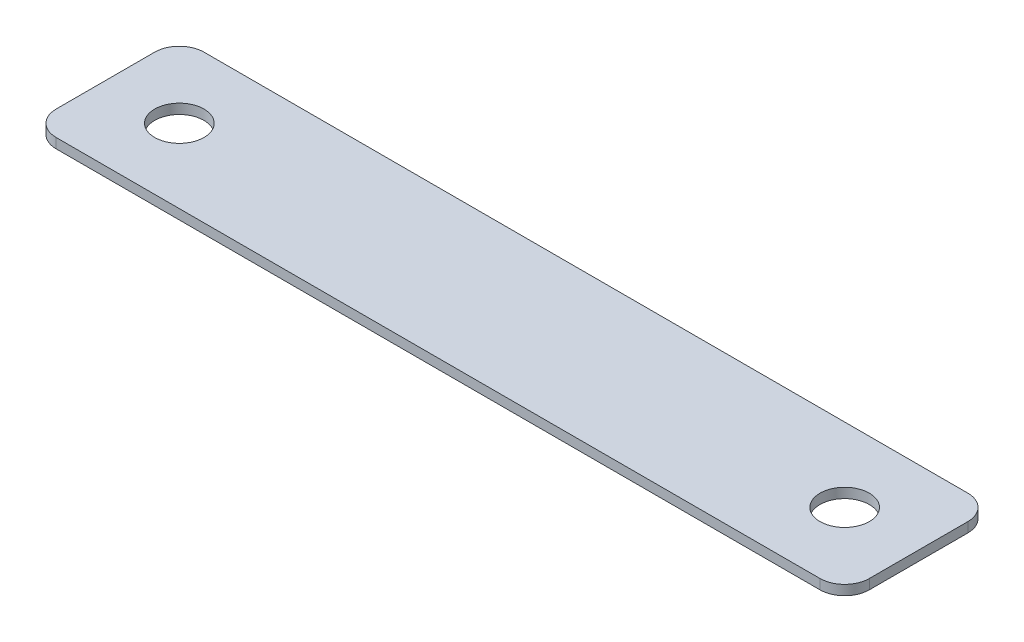
ISO-10303-21;
HEADER;
FILE_DESCRIPTION(('STEP AP214'),'2;1');
FILE_NAME('part.step','',(''),(''),'','','');
FILE_SCHEMA(('AUTOMOTIVE_DESIGN { 1 0 10303 214 1 1 1 1 }'));
ENDSEC;
DATA;
#1=APPLICATION_CONTEXT('core data for automotive mechanical design processes');
#2=APPLICATION_PROTOCOL_DEFINITION('international standard','automotive_design',2000,#1);
#3=PRODUCT_CONTEXT('',#1,'mechanical');
#4=PRODUCT('Part','Part','',(#3));
#5=PRODUCT_RELATED_PRODUCT_CATEGORY('part','',(#4));
#6=PRODUCT_DEFINITION_FORMATION('','',#4);
#7=PRODUCT_DEFINITION_CONTEXT('part definition',#1,'design');
#8=PRODUCT_DEFINITION('design','',#6,#7);
#9=PRODUCT_DEFINITION_SHAPE('','',#8);
#10=(LENGTH_UNIT() NAMED_UNIT(*) SI_UNIT(.MILLI.,.METRE.));
#11=(NAMED_UNIT(*) PLANE_ANGLE_UNIT() SI_UNIT($,.RADIAN.));
#12=(NAMED_UNIT(*) SI_UNIT($,.STERADIAN.) SOLID_ANGLE_UNIT());
#13=UNCERTAINTY_MEASURE_WITH_UNIT(LENGTH_MEASURE(1.E-05),#10,'distance_accuracy_value','');
#14=(GEOMETRIC_REPRESENTATION_CONTEXT(3) GLOBAL_UNCERTAINTY_ASSIGNED_CONTEXT((#13)) GLOBAL_UNIT_ASSIGNED_CONTEXT((#10,
#11,#12)) REPRESENTATION_CONTEXT('',''));
#15=CARTESIAN_POINT('',(0.,0.,0.));
#16=DIRECTION('',(0.,0.,1.));
#17=DIRECTION('',(1.,0.,0.));
#18=AXIS2_PLACEMENT_3D('',#15,#16,#17);
#19=CARTESIAN_POINT('',(203.2,2.54,-6.35));
#20=DIRECTION('',(0.,-1.,0.));
#21=DIRECTION('',(0.,0.,-1.));
#22=AXIS2_PLACEMENT_3D('',#19,#20,#21);
#23=PLANE('',#22);
#24=CARTESIAN_POINT('',(203.2,2.54,-6.35));
#25=DIRECTION('',(0.,1.,0.));
#26=DIRECTION('',(0.,0.,-1.));
#27=AXIS2_PLACEMENT_3D('',#24,#25,#26);
#28=CIRCLE('',#27,6.35);
#29=CARTESIAN_POINT('',(203.2,2.54,0.));
#30=VERTEX_POINT('',#29);
#31=CARTESIAN_POINT('',(209.55,2.54,-6.35));
#32=VERTEX_POINT('',#31);
#33=EDGE_CURVE('E145',#30,#32,#28,.T.);
#34=ORIENTED_EDGE('',*,*,#33,.T.);
#35=DIRECTION('',(0.,0.,-1.));
#36=VECTOR('',#35,1.);
#37=CARTESIAN_POINT('',(209.55,2.54,-31.75));
#38=LINE('',#37,#36);
#39=CARTESIAN_POINT('',(209.55,2.54,-31.75));
#40=VERTEX_POINT('',#39);
#41=EDGE_CURVE('E93',#32,#40,#38,.T.);
#42=ORIENTED_EDGE('',*,*,#41,.T.);
#43=CARTESIAN_POINT('',(203.2,2.54,-31.75));
#44=DIRECTION('',(0.,1.,0.));
#45=DIRECTION('',(0.,0.,1.));
#46=AXIS2_PLACEMENT_3D('',#43,#44,#45);
#47=CIRCLE('',#46,6.35);
#48=CARTESIAN_POINT('',(203.2,2.54,-38.1));
#49=VERTEX_POINT('',#48);
#50=EDGE_CURVE('E160',#40,#49,#47,.T.);
#51=ORIENTED_EDGE('',*,*,#50,.T.);
#52=DIRECTION('',(-1.,0.,0.));
#53=VECTOR('',#52,1.);
#54=CARTESIAN_POINT('',(6.35000000000004,2.54,-38.1));
#55=LINE('',#54,#53);
#56=CARTESIAN_POINT('',(6.35000000000004,2.54,-38.1));
#57=VERTEX_POINT('',#56);
#58=EDGE_CURVE('E173',#49,#57,#55,.T.);
#59=ORIENTED_EDGE('',*,*,#58,.T.);
#60=CARTESIAN_POINT('',(6.35,2.54,-31.75));
#61=DIRECTION('',(0.,1.,0.));
#62=DIRECTION('',(0.,0.,-1.));
#63=AXIS2_PLACEMENT_3D('',#60,#61,#62);
#64=CIRCLE('',#63,6.35);
#65=CARTESIAN_POINT('',(0.,2.54,-31.7499999999999));
#66=VERTEX_POINT('',#65);
#67=EDGE_CURVE('E112',#57,#66,#64,.T.);
#68=ORIENTED_EDGE('',*,*,#67,.T.);
#69=DIRECTION('',(0.,0.,1.));
#70=VECTOR('',#69,1.);
#71=CARTESIAN_POINT('',(0.,2.54,-6.35000000000004));
#72=LINE('',#71,#70);
#73=CARTESIAN_POINT('',(0.,2.54,-6.35000000000004));
#74=VERTEX_POINT('',#73);
#75=EDGE_CURVE('E106',#66,#74,#72,.T.);
#76=ORIENTED_EDGE('',*,*,#75,.T.);
#77=CARTESIAN_POINT('',(6.35,2.54,-6.35));
#78=DIRECTION('',(0.,1.,0.));
#79=DIRECTION('',(0.,0.,-1.));
#80=AXIS2_PLACEMENT_3D('',#77,#78,#79);
#81=CIRCLE('',#80,6.35);
#82=CARTESIAN_POINT('',(6.35000000000005,2.54,0.));
#83=VERTEX_POINT('',#82);
#84=EDGE_CURVE('E110',#74,#83,#81,.T.);
#85=ORIENTED_EDGE('',*,*,#84,.T.);
#86=DIRECTION('',(1.,0.,0.));
#87=VECTOR('',#86,1.);
#88=CARTESIAN_POINT('',(6.35000000000004,2.54,0.));
#89=LINE('',#88,#87);
#90=EDGE_CURVE('E50',#83,#30,#89,.T.);
#91=ORIENTED_EDGE('',*,*,#90,.T.);
#92=EDGE_LOOP('',(#34,#42,#51,#59,#68,#76,#85,#91));
#93=FACE_BOUND('',#92,.T.);
#94=CARTESIAN_POINT('',(19.05,2.54,-19.05));
#95=DIRECTION('',(0.,1.,0.));
#96=DIRECTION('',(0.,0.,1.));
#97=AXIS2_PLACEMENT_3D('',#94,#95,#96);
#98=CIRCLE('',#97,6.35);
#99=CARTESIAN_POINT('',(19.05,2.54,-12.7));
#100=VERTEX_POINT('',#99);
#101=EDGE_CURVE('E134',#100,#100,#98,.T.);
#102=ORIENTED_EDGE('',*,*,#101,.F.);
#103=EDGE_LOOP('',(#102));
#104=FACE_BOUND('',#103,.T.);
#105=CARTESIAN_POINT('',(190.5,2.54,-19.05));
#106=DIRECTION('',(0.,1.,0.));
#107=DIRECTION('',(0.,0.,1.));
#108=AXIS2_PLACEMENT_3D('',#105,#106,#107);
#109=CIRCLE('',#108,6.35);
#110=CARTESIAN_POINT('',(190.5,2.54,-12.7));
#111=VERTEX_POINT('',#110);
#112=EDGE_CURVE('E182',#111,#111,#109,.T.);
#113=ORIENTED_EDGE('',*,*,#112,.F.);
#114=EDGE_LOOP('',(#113));
#115=FACE_BOUND('',#114,.T.);
#116=ADVANCED_FACE('F33',(#93,#104,#115),#23,.F.);
#117=CARTESIAN_POINT('',(203.2,0.,-6.35));
#118=DIRECTION('',(0.,-1.,0.));
#119=DIRECTION('',(0.,0.,-1.));
#120=AXIS2_PLACEMENT_3D('',#117,#118,#119);
#121=PLANE('',#120);
#122=CARTESIAN_POINT('',(19.05,0.,-19.05));
#123=DIRECTION('',(0.,1.,0.));
#124=DIRECTION('',(0.,0.,1.));
#125=AXIS2_PLACEMENT_3D('',#122,#123,#124);
#126=CIRCLE('',#125,6.35);
#127=CARTESIAN_POINT('',(19.05,0.,-12.7));
#128=VERTEX_POINT('',#127);
#129=EDGE_CURVE('E179',#128,#128,#126,.T.);
#130=ORIENTED_EDGE('',*,*,#129,.T.);
#131=EDGE_LOOP('',(#130));
#132=FACE_BOUND('',#131,.T.);
#133=CARTESIAN_POINT('',(203.2,0.,-6.35));
#134=DIRECTION('',(0.,1.,0.));
#135=DIRECTION('',(0.,0.,-1.));
#136=AXIS2_PLACEMENT_3D('',#133,#134,#135);
#137=CIRCLE('',#136,6.35);
#138=CARTESIAN_POINT('',(203.2,0.,0.));
#139=VERTEX_POINT('',#138);
#140=CARTESIAN_POINT('',(209.55,0.,-6.35));
#141=VERTEX_POINT('',#140);
#142=EDGE_CURVE('E130',#139,#141,#137,.T.);
#143=ORIENTED_EDGE('',*,*,#142,.F.);
#144=DIRECTION('',(1.,0.,0.));
#145=VECTOR('',#144,1.);
#146=CARTESIAN_POINT('',(6.35000000000004,0.,0.));
#147=LINE('',#146,#145);
#148=CARTESIAN_POINT('',(6.35000000000005,0.,0.));
#149=VERTEX_POINT('',#148);
#150=EDGE_CURVE('E85',#149,#139,#147,.T.);
#151=ORIENTED_EDGE('',*,*,#150,.F.);
#152=CARTESIAN_POINT('',(6.35,0.,-6.35));
#153=DIRECTION('',(0.,1.,0.));
#154=DIRECTION('',(0.,0.,-1.));
#155=AXIS2_PLACEMENT_3D('',#152,#153,#154);
#156=CIRCLE('',#155,6.35);
#157=CARTESIAN_POINT('',(0.,0.,-6.35000000000004));
#158=VERTEX_POINT('',#157);
#159=EDGE_CURVE('E79',#158,#149,#156,.T.);
#160=ORIENTED_EDGE('',*,*,#159,.F.);
#161=DIRECTION('',(0.,0.,1.));
#162=VECTOR('',#161,1.);
#163=CARTESIAN_POINT('',(0.,0.,-6.35000000000004));
#164=LINE('',#163,#162);
#165=CARTESIAN_POINT('',(0.,0.,-31.7499999999999));
#166=VERTEX_POINT('',#165);
#167=EDGE_CURVE('E120',#166,#158,#164,.T.);
#168=ORIENTED_EDGE('',*,*,#167,.F.);
#169=CARTESIAN_POINT('',(6.35,0.,-31.75));
#170=DIRECTION('',(0.,1.,0.));
#171=DIRECTION('',(0.,0.,-1.));
#172=AXIS2_PLACEMENT_3D('',#169,#170,#171);
#173=CIRCLE('',#172,6.35);
#174=CARTESIAN_POINT('',(6.35000000000004,0.,-38.1));
#175=VERTEX_POINT('',#174);
#176=EDGE_CURVE('E140',#175,#166,#173,.T.);
#177=ORIENTED_EDGE('',*,*,#176,.F.);
#178=DIRECTION('',(-1.,0.,0.));
#179=VECTOR('',#178,1.);
#180=CARTESIAN_POINT('',(6.35000000000004,0.,-38.1));
#181=LINE('',#180,#179);
#182=CARTESIAN_POINT('',(203.2,0.,-38.1));
#183=VERTEX_POINT('',#182);
#184=EDGE_CURVE('E138',#183,#175,#181,.T.);
#185=ORIENTED_EDGE('',*,*,#184,.F.);
#186=CARTESIAN_POINT('',(203.2,0.,-31.75));
#187=DIRECTION('',(0.,1.,0.));
#188=DIRECTION('',(0.,0.,1.));
#189=AXIS2_PLACEMENT_3D('',#186,#187,#188);
#190=CIRCLE('',#189,6.35);
#191=CARTESIAN_POINT('',(209.55,0.,-31.75));
#192=VERTEX_POINT('',#191);
#193=EDGE_CURVE('E136',#192,#183,#190,.T.);
#194=ORIENTED_EDGE('',*,*,#193,.F.);
#195=DIRECTION('',(0.,0.,-1.));
#196=VECTOR('',#195,1.);
#197=CARTESIAN_POINT('',(209.55,0.,-31.75));
#198=LINE('',#197,#196);
#199=EDGE_CURVE('E133',#141,#192,#198,.T.);
#200=ORIENTED_EDGE('',*,*,#199,.F.);
#201=EDGE_LOOP('',(#143,#151,#160,#168,#177,#185,#194,#200));
#202=FACE_BOUND('',#201,.T.);
#203=CARTESIAN_POINT('',(190.5,0.,-19.05));
#204=DIRECTION('',(0.,1.,0.));
#205=DIRECTION('',(0.,0.,1.));
#206=AXIS2_PLACEMENT_3D('',#203,#204,#205);
#207=CIRCLE('',#206,6.35);
#208=CARTESIAN_POINT('',(190.5,0.,-12.7));
#209=VERTEX_POINT('',#208);
#210=EDGE_CURVE('E185',#209,#209,#207,.T.);
#211=ORIENTED_EDGE('',*,*,#210,.T.);
#212=EDGE_LOOP('',(#211));
#213=FACE_BOUND('',#212,.T.);
#214=ADVANCED_FACE('F164',(#132,#202,#213),#121,.T.);
#215=CARTESIAN_POINT('',(203.2,2.54,-6.35));
#216=DIRECTION('',(0.,-1.,0.));
#217=DIRECTION('',(0.,0.,-1.));
#218=AXIS2_PLACEMENT_3D('',#215,#216,#217);
#219=CYLINDRICAL_SURFACE('',#218,6.35);
#220=ORIENTED_EDGE('',*,*,#142,.T.);
#221=DIRECTION('',(0.,-1.,0.));
#222=VECTOR('',#221,1.);
#223=CARTESIAN_POINT('',(209.55,2.54,-6.35));
#224=LINE('',#223,#222);
#225=EDGE_CURVE('E11',#32,#141,#224,.T.);
#226=ORIENTED_EDGE('',*,*,#225,.F.);
#227=ORIENTED_EDGE('',*,*,#33,.F.);
#228=DIRECTION('',(0.,-1.,0.));
#229=VECTOR('',#228,1.);
#230=CARTESIAN_POINT('',(203.2,2.54,0.));
#231=LINE('',#230,#229);
#232=EDGE_CURVE('E126',#30,#139,#231,.T.);
#233=ORIENTED_EDGE('',*,*,#232,.T.);
#234=EDGE_LOOP('',(#220,#226,#227,#233));
#235=FACE_BOUND('',#234,.T.);
#236=ADVANCED_FACE('F35',(#235),#219,.T.);
#237=CARTESIAN_POINT('',(209.55,2.54,-31.75));
#238=DIRECTION('',(-1.,0.,0.));
#239=DIRECTION('',(0.,0.,1.));
#240=AXIS2_PLACEMENT_3D('',#237,#238,#239);
#241=PLANE('',#240);
#242=ORIENTED_EDGE('',*,*,#199,.T.);
#243=DIRECTION('',(0.,-1.,0.));
#244=VECTOR('',#243,1.);
#245=CARTESIAN_POINT('',(209.55,2.54,-31.75));
#246=LINE('',#245,#244);
#247=EDGE_CURVE('E42',#40,#192,#246,.T.);
#248=ORIENTED_EDGE('',*,*,#247,.F.);
#249=ORIENTED_EDGE('',*,*,#41,.F.);
#250=ORIENTED_EDGE('',*,*,#225,.T.);
#251=EDGE_LOOP('',(#242,#248,#249,#250));
#252=FACE_BOUND('',#251,.T.);
#253=ADVANCED_FACE('F217',(#252),#241,.F.);
#254=CARTESIAN_POINT('',(203.2,2.54,-31.75));
#255=DIRECTION('',(0.,-1.,0.));
#256=DIRECTION('',(0.,0.,-1.));
#257=AXIS2_PLACEMENT_3D('',#254,#255,#256);
#258=CYLINDRICAL_SURFACE('',#257,6.35);
#259=ORIENTED_EDGE('',*,*,#193,.T.);
#260=DIRECTION('',(0.,-1.,0.));
#261=VECTOR('',#260,1.);
#262=CARTESIAN_POINT('',(203.2,2.54,-38.1));
#263=LINE('',#262,#261);
#264=EDGE_CURVE('E152',#49,#183,#263,.T.);
#265=ORIENTED_EDGE('',*,*,#264,.F.);
#266=ORIENTED_EDGE('',*,*,#50,.F.);
#267=ORIENTED_EDGE('',*,*,#247,.T.);
#268=EDGE_LOOP('',(#259,#265,#266,#267));
#269=FACE_BOUND('',#268,.T.);
#270=ADVANCED_FACE('F158',(#269),#258,.T.);
#271=CARTESIAN_POINT('',(6.35000000000004,2.54,-38.1));
#272=DIRECTION('',(0.,0.,1.));
#273=DIRECTION('',(1.,0.,0.));
#274=AXIS2_PLACEMENT_3D('',#271,#272,#273);
#275=PLANE('',#274);
#276=ORIENTED_EDGE('',*,*,#184,.T.);
#277=DIRECTION('',(0.,-1.,0.));
#278=VECTOR('',#277,1.);
#279=CARTESIAN_POINT('',(6.35000000000004,2.54,-38.1));
#280=LINE('',#279,#278);
#281=EDGE_CURVE('E149',#57,#175,#280,.T.);
#282=ORIENTED_EDGE('',*,*,#281,.F.);
#283=ORIENTED_EDGE('',*,*,#58,.F.);
#284=ORIENTED_EDGE('',*,*,#264,.T.);
#285=EDGE_LOOP('',(#276,#282,#283,#284));
#286=FACE_BOUND('',#285,.T.);
#287=ADVANCED_FACE('F169',(#286),#275,.F.);
#288=CARTESIAN_POINT('',(6.35,2.54,-31.75));
#289=DIRECTION('',(0.,-1.,0.));
#290=DIRECTION('',(0.,0.,-1.));
#291=AXIS2_PLACEMENT_3D('',#288,#289,#290);
#292=CYLINDRICAL_SURFACE('',#291,6.35);
#293=ORIENTED_EDGE('',*,*,#176,.T.);
#294=DIRECTION('',(0.,-1.,0.));
#295=VECTOR('',#294,1.);
#296=CARTESIAN_POINT('',(0.,2.54,-31.7499999999999));
#297=LINE('',#296,#295);
#298=EDGE_CURVE('E121',#66,#166,#297,.T.);
#299=ORIENTED_EDGE('',*,*,#298,.F.);
#300=ORIENTED_EDGE('',*,*,#67,.F.);
#301=ORIENTED_EDGE('',*,*,#281,.T.);
#302=EDGE_LOOP('',(#293,#299,#300,#301));
#303=FACE_BOUND('',#302,.T.);
#304=ADVANCED_FACE('F172',(#303),#292,.T.);
#305=CARTESIAN_POINT('',(0.,2.54,-6.35000000000004));
#306=DIRECTION('',(1.,0.,0.));
#307=DIRECTION('',(0.,0.,-1.));
#308=AXIS2_PLACEMENT_3D('',#305,#306,#307);
#309=PLANE('',#308);
#310=ORIENTED_EDGE('',*,*,#167,.T.);
#311=DIRECTION('',(0.,-1.,0.));
#312=VECTOR('',#311,1.);
#313=CARTESIAN_POINT('',(0.,2.54,-6.35000000000004));
#314=LINE('',#313,#312);
#315=EDGE_CURVE('E117',#74,#158,#314,.T.);
#316=ORIENTED_EDGE('',*,*,#315,.F.);
#317=ORIENTED_EDGE('',*,*,#75,.F.);
#318=ORIENTED_EDGE('',*,*,#298,.T.);
#319=EDGE_LOOP('',(#310,#316,#317,#318));
#320=FACE_BOUND('',#319,.T.);
#321=ADVANCED_FACE('F118',(#320),#309,.F.);
#322=CARTESIAN_POINT('',(6.35,2.54,-6.35));
#323=DIRECTION('',(0.,-1.,0.));
#324=DIRECTION('',(0.,0.,-1.));
#325=AXIS2_PLACEMENT_3D('',#322,#323,#324);
#326=CYLINDRICAL_SURFACE('',#325,6.35);
#327=ORIENTED_EDGE('',*,*,#159,.T.);
#328=DIRECTION('',(0.,-1.,0.));
#329=VECTOR('',#328,1.);
#330=CARTESIAN_POINT('',(6.35000000000005,2.54,0.));
#331=LINE('',#330,#329);
#332=EDGE_CURVE('E122',#83,#149,#331,.T.);
#333=ORIENTED_EDGE('',*,*,#332,.F.);
#334=ORIENTED_EDGE('',*,*,#84,.F.);
#335=ORIENTED_EDGE('',*,*,#315,.T.);
#336=EDGE_LOOP('',(#327,#333,#334,#335));
#337=FACE_BOUND('',#336,.T.);
#338=ADVANCED_FACE('F124',(#337),#326,.T.);
#339=CARTESIAN_POINT('',(6.35000000000004,2.54,0.));
#340=DIRECTION('',(0.,0.,-1.));
#341=DIRECTION('',(-1.,0.,0.));
#342=AXIS2_PLACEMENT_3D('',#339,#340,#341);
#343=PLANE('',#342);
#344=ORIENTED_EDGE('',*,*,#150,.T.);
#345=ORIENTED_EDGE('',*,*,#232,.F.);
#346=ORIENTED_EDGE('',*,*,#90,.F.);
#347=ORIENTED_EDGE('',*,*,#332,.T.);
#348=EDGE_LOOP('',(#344,#345,#346,#347));
#349=FACE_BOUND('',#348,.T.);
#350=ADVANCED_FACE('F205',(#349),#343,.F.);
#351=CARTESIAN_POINT('',(19.05,2.54,-19.05));
#352=DIRECTION('',(0.,-1.,0.));
#353=DIRECTION('',(0.,0.,-1.));
#354=AXIS2_PLACEMENT_3D('',#351,#352,#353);
#355=CYLINDRICAL_SURFACE('',#354,6.35);
#356=ORIENTED_EDGE('',*,*,#101,.T.);
#357=EDGE_LOOP('',(#356));
#358=FACE_BOUND('',#357,.T.);
#359=ORIENTED_EDGE('',*,*,#129,.F.);
#360=EDGE_LOOP('',(#359));
#361=FACE_BOUND('',#360,.T.);
#362=ADVANCED_FACE('F202',(#358,#361),#355,.F.);
#363=CARTESIAN_POINT('',(190.5,2.54,-19.05));
#364=DIRECTION('',(0.,-1.,0.));
#365=DIRECTION('',(0.,0.,-1.));
#366=AXIS2_PLACEMENT_3D('',#363,#364,#365);
#367=CYLINDRICAL_SURFACE('',#366,6.35);
#368=ORIENTED_EDGE('',*,*,#112,.T.);
#369=EDGE_LOOP('',(#368));
#370=FACE_BOUND('',#369,.T.);
#371=ORIENTED_EDGE('',*,*,#210,.F.);
#372=EDGE_LOOP('',(#371));
#373=FACE_BOUND('',#372,.T.);
#374=ADVANCED_FACE('F191',(#370,#373),#367,.F.);
#375=CLOSED_SHELL('',(#116,#214,#236,#253,#270,#287,#304,#321,#338,#350,#362,#374));
#376=MANIFOLD_SOLID_BREP('B2',#375);
#377=ADVANCED_BREP_SHAPE_REPRESENTATION('',(#18,#376),#14);
#378=SHAPE_DEFINITION_REPRESENTATION(#9,#377);
ENDSEC;
END-ISO-10303-21;
